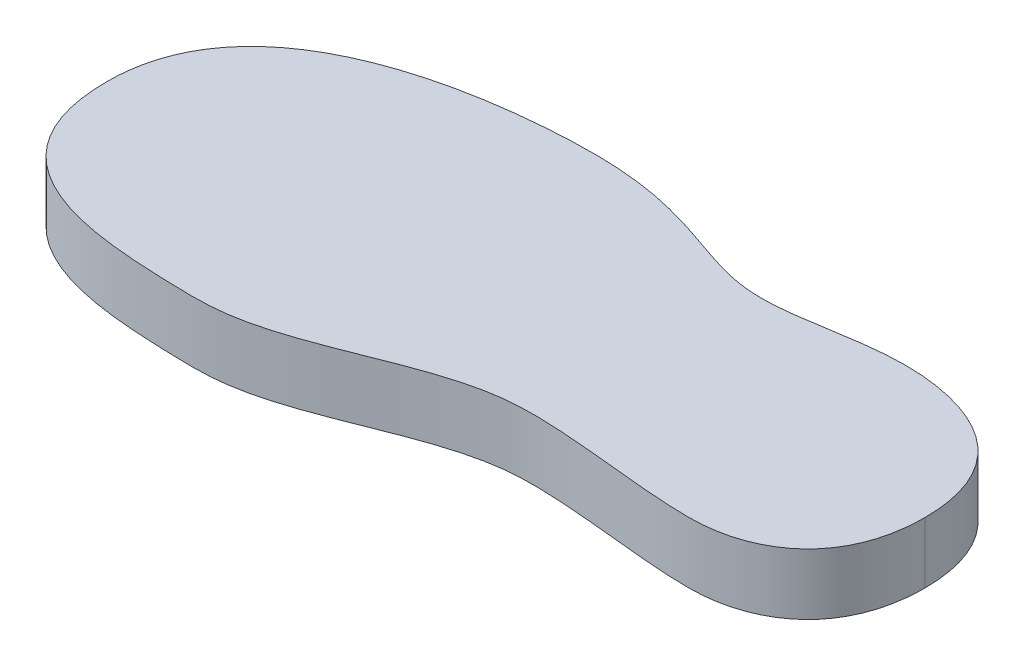
ISO-10303-21;
HEADER;
FILE_DESCRIPTION(('STEP AP214'),'2;1');
FILE_NAME('part.step','',(''),(''),'','','');
FILE_SCHEMA(('AUTOMOTIVE_DESIGN { 1 0 10303 214 1 1 1 1 }'));
ENDSEC;
DATA;
#1=APPLICATION_CONTEXT('core data for automotive mechanical design processes');
#2=APPLICATION_PROTOCOL_DEFINITION('international standard','automotive_design',2000,#1);
#3=PRODUCT_CONTEXT('',#1,'mechanical');
#4=PRODUCT('Part','Part','',(#3));
#5=PRODUCT_RELATED_PRODUCT_CATEGORY('part','',(#4));
#6=PRODUCT_DEFINITION_FORMATION('','',#4);
#7=PRODUCT_DEFINITION_CONTEXT('part definition',#1,'design');
#8=PRODUCT_DEFINITION('design','',#6,#7);
#9=PRODUCT_DEFINITION_SHAPE('','',#8);
#10=(LENGTH_UNIT() NAMED_UNIT(*) SI_UNIT(.MILLI.,.METRE.));
#11=(NAMED_UNIT(*) PLANE_ANGLE_UNIT() SI_UNIT($,.RADIAN.));
#12=(NAMED_UNIT(*) SI_UNIT($,.STERADIAN.) SOLID_ANGLE_UNIT());
#13=UNCERTAINTY_MEASURE_WITH_UNIT(LENGTH_MEASURE(1.E-05),#10,'distance_accuracy_value','');
#14=(GEOMETRIC_REPRESENTATION_CONTEXT(3) GLOBAL_UNCERTAINTY_ASSIGNED_CONTEXT((#13)) GLOBAL_UNIT_ASSIGNED_CONTEXT((#10,
#11,#12)) REPRESENTATION_CONTEXT('',''));
#15=CARTESIAN_POINT('',(0.,0.,0.));
#16=DIRECTION('',(0.,0.,1.));
#17=DIRECTION('',(1.,0.,0.));
#18=AXIS2_PLACEMENT_3D('',#15,#16,#17);
#19=CARTESIAN_POINT('',(-109.1,10.,5.10000000000001));
#20=CARTESIAN_POINT('',(-109.1,10.,26.6432604195566));
#21=CARTESIAN_POINT('',(-85.1553950145299,10.,28.3276547789505));
#22=CARTESIAN_POINT('',(-58.1139650986849,10.,28.9794823332857));
#23=CARTESIAN_POINT('',(-41.2186170202285,10.,17.3728864624875));
#24=CARTESIAN_POINT('',(-19.7963856893989,10.,17.3572232978145));
#25=CARTESIAN_POINT('',(-8.53740891077201,10.,19.1352043184809));
#26=CARTESIAN_POINT('',(9.62833919463686,10.,19.5586498872572));
#27=CARTESIAN_POINT('',(19.6,10.,12.7982081123207));
#28=CARTESIAN_POINT('',(19.6,10.,0.));
#29=B_SPLINE_CURVE_WITH_KNOTS('',3,(#19,#20,#21,#22,#23,#24,#25,#26,#27,#28),.UNSPECIFIED.,.F.,
.F.,(4,1,1,1,1,1,1,4),(0.,0.259156642468506,0.320592471258994,0.581717641610898,
0.633520200090735,0.786815497577522,0.825379668787033,1.),.UNSPECIFIED.);
#30=DIRECTION('',(0.,-1.,0.));
#31=VECTOR('',#30,1.);
#32=SURFACE_OF_LINEAR_EXTRUSION('',#29,#31);
#33=CARTESIAN_POINT('',(-109.1,0.,5.10000000000001));
#34=CARTESIAN_POINT('',(-109.1,0.,26.6432604195566));
#35=CARTESIAN_POINT('',(-85.1553950145299,0.,28.3276547789505));
#36=CARTESIAN_POINT('',(-58.1139650986849,0.,28.9794823332857));
#37=CARTESIAN_POINT('',(-41.2186170202285,0.,17.3728864624875));
#38=CARTESIAN_POINT('',(-19.7963856893989,0.,17.3572232978145));
#39=CARTESIAN_POINT('',(-8.53740891077201,0.,19.1352043184809));
#40=CARTESIAN_POINT('',(9.62833919463686,0.,19.5586498872572));
#41=CARTESIAN_POINT('',(19.6,0.,12.7982081123207));
#42=CARTESIAN_POINT('',(19.6,0.,0.));
#43=B_SPLINE_CURVE_WITH_KNOTS('',3,(#33,#34,#35,#36,#37,#38,#39,#40,#41,#42),.UNSPECIFIED.,.F.,
.F.,(4,1,1,1,1,1,1,4),(0.,0.259156642468506,0.320592471258994,0.581717641610898,
0.633520200090735,0.786815497577522,0.825379668787033,1.),.UNSPECIFIED.);
#44=CARTESIAN_POINT('',(-109.1,0.,5.10000000000001));
#45=VERTEX_POINT('',#44);
#46=CARTESIAN_POINT('',(19.6,0.,0.));
#47=VERTEX_POINT('',#46);
#48=EDGE_CURVE('E65',#45,#47,#43,.T.);
#49=ORIENTED_EDGE('',*,*,#48,.T.);
#50=DIRECTION('',(0.,-1.,0.));
#51=VECTOR('',#50,1.);
#52=CARTESIAN_POINT('',(19.6,10.,0.));
#53=LINE('',#52,#51);
#54=CARTESIAN_POINT('',(19.6,10.,0.));
#55=VERTEX_POINT('',#54);
#56=EDGE_CURVE('E11',#55,#47,#53,.T.);
#57=ORIENTED_EDGE('',*,*,#56,.F.);
#58=CARTESIAN_POINT('',(-109.1,10.,5.10000000000001));
#59=VERTEX_POINT('',#58);
#60=EDGE_CURVE('E64',#59,#55,#29,.T.);
#61=ORIENTED_EDGE('',*,*,#60,.F.);
#62=DIRECTION('',(0.,-1.,0.));
#63=VECTOR('',#62,1.);
#64=CARTESIAN_POINT('',(-109.1,10.,5.10000000000001));
#65=LINE('',#64,#63);
#66=EDGE_CURVE('E42',#59,#45,#65,.T.);
#67=ORIENTED_EDGE('',*,*,#66,.T.);
#68=EDGE_LOOP('',(#49,#57,#61,#67));
#69=FACE_BOUND('',#68,.T.);
#70=ADVANCED_FACE('F33',(#69),#32,.F.);
#71=CARTESIAN_POINT('',(19.6,10.,0.));
#72=CARTESIAN_POINT('',(19.6,10.,-14.2893005053946));
#73=CARTESIAN_POINT('',(7.1736225020473,10.,-19.9357854102501));
#74=CARTESIAN_POINT('',(-9.83148258116679,10.,-20.0891216466197));
#75=CARTESIAN_POINT('',(-19.7451730899004,10.,-17.5626112963894));
#76=CARTESIAN_POINT('',(-34.2200348693917,10.,-17.8388464603226));
#77=CARTESIAN_POINT('',(-43.0008860041439,10.,-24.4073740369768));
#78=CARTESIAN_POINT('',(-73.8093594301823,10.,-24.6958422181311));
#79=CARTESIAN_POINT('',(-109.1,10.,-18.3105600240905));
#80=CARTESIAN_POINT('',(-109.1,10.,5.10000000000001));
#81=B_SPLINE_CURVE_WITH_KNOTS('',3,(#71,#72,#73,#74,#75,#76,#77,#78,#79,#80),.UNSPECIFIED.,.F.,
.F.,(4,1,1,1,1,1,1,4),(0.,0.235629762694765,0.280037523195014,0.425850929246104,
0.474049388826953,0.713823659422654,0.769415898922405,1.),.UNSPECIFIED.);
#82=DIRECTION('',(0.,-1.,0.));
#83=VECTOR('',#82,1.);
#84=SURFACE_OF_LINEAR_EXTRUSION('',#81,#83);
#85=CARTESIAN_POINT('',(19.6,0.,0.));
#86=CARTESIAN_POINT('',(19.6,0.,-14.2893005053946));
#87=CARTESIAN_POINT('',(7.1736225020473,0.,-19.9357854102501));
#88=CARTESIAN_POINT('',(-9.83148258116679,0.,-20.0891216466197));
#89=CARTESIAN_POINT('',(-19.7451730899004,0.,-17.5626112963894));
#90=CARTESIAN_POINT('',(-34.2200348693917,0.,-17.8388464603226));
#91=CARTESIAN_POINT('',(-43.0008860041439,0.,-24.4073740369768));
#92=CARTESIAN_POINT('',(-73.8093594301823,0.,-24.6958422181311));
#93=CARTESIAN_POINT('',(-109.1,0.,-18.3105600240905));
#94=CARTESIAN_POINT('',(-109.1,0.,5.10000000000001));
#95=B_SPLINE_CURVE_WITH_KNOTS('',3,(#85,#86,#87,#88,#89,#90,#91,#92,#93,#94),.UNSPECIFIED.,.F.,
.F.,(4,1,1,1,1,1,1,4),(0.,0.235629762694765,0.280037523195014,0.425850929246104,
0.474049388826953,0.713823659422654,0.769415898922405,1.),.UNSPECIFIED.);
#96=EDGE_CURVE('E57',#47,#45,#95,.T.);
#97=ORIENTED_EDGE('',*,*,#96,.T.);
#98=ORIENTED_EDGE('',*,*,#66,.F.);
#99=EDGE_CURVE('E49',#55,#59,#81,.T.);
#100=ORIENTED_EDGE('',*,*,#99,.F.);
#101=ORIENTED_EDGE('',*,*,#56,.T.);
#102=EDGE_LOOP('',(#97,#98,#100,#101));
#103=FACE_BOUND('',#102,.T.);
#104=ADVANCED_FACE('F60',(#103),#84,.F.);
#105=CARTESIAN_POINT('',(-42.7866665549931,10.,20.4642477072215));
#106=DIRECTION('',(0.,1.,0.));
#107=DIRECTION('',(0.,0.,1.));
#108=AXIS2_PLACEMENT_3D('',#105,#106,#107);
#109=PLANE('',#108);
#110=ORIENTED_EDGE('',*,*,#60,.T.);
#111=ORIENTED_EDGE('',*,*,#99,.T.);
#112=EDGE_LOOP('',(#110,#111));
#113=FACE_BOUND('',#112,.T.);
#114=ADVANCED_FACE('F92',(#113),#109,.T.);
#115=CARTESIAN_POINT('',(-42.7866665549931,0.,20.4642477072215));
#116=DIRECTION('',(0.,1.,0.));
#117=DIRECTION('',(0.,0.,1.));
#118=AXIS2_PLACEMENT_3D('',#115,#116,#117);
#119=PLANE('',#118);
#120=ORIENTED_EDGE('',*,*,#48,.F.);
#121=ORIENTED_EDGE('',*,*,#96,.F.);
#122=EDGE_LOOP('',(#120,#121));
#123=FACE_BOUND('',#122,.T.);
#124=ADVANCED_FACE('F68',(#123),#119,.F.);
#125=CLOSED_SHELL('',(#70,#104,#114,#124));
#126=MANIFOLD_SOLID_BREP('B2',#125);
#127=ADVANCED_BREP_SHAPE_REPRESENTATION('',(#18,#126),#14);
#128=SHAPE_DEFINITION_REPRESENTATION(#9,#127);
ENDSEC;
END-ISO-10303-21;
